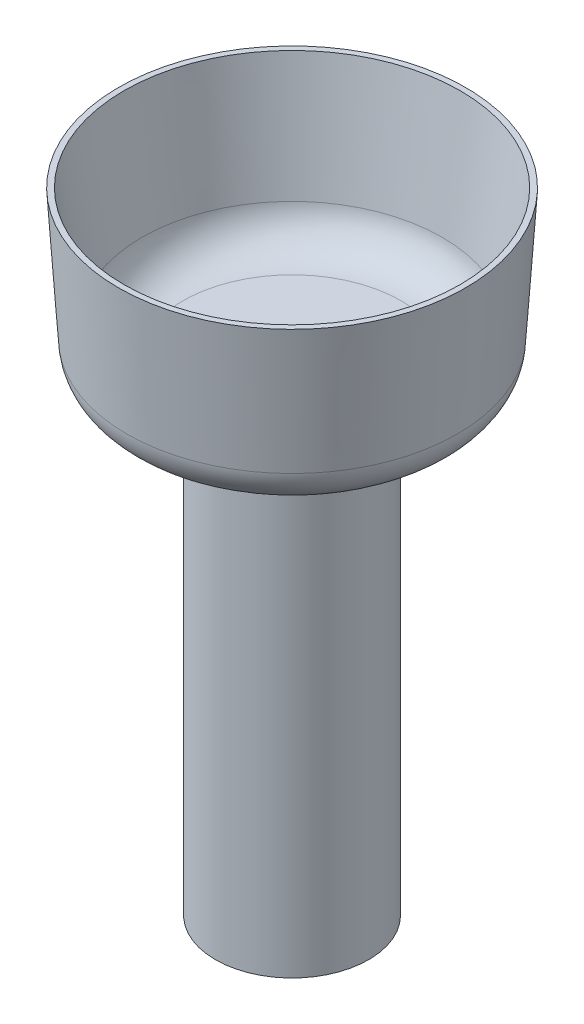
ISO-10303-21;
HEADER;
FILE_DESCRIPTION(('STEP AP214'),'2;1');
FILE_NAME('part.step','',(''),(''),'','','');
FILE_SCHEMA(('AUTOMOTIVE_DESIGN { 1 0 10303 214 1 1 1 1 }'));
ENDSEC;
DATA;
#1=APPLICATION_CONTEXT('core data for automotive mechanical design processes');
#2=APPLICATION_PROTOCOL_DEFINITION('international standard','automotive_design',2000,#1);
#3=PRODUCT_CONTEXT('',#1,'mechanical');
#4=PRODUCT('Part','Part','',(#3));
#5=PRODUCT_RELATED_PRODUCT_CATEGORY('part','',(#4));
#6=PRODUCT_DEFINITION_FORMATION('','',#4);
#7=PRODUCT_DEFINITION_CONTEXT('part definition',#1,'design');
#8=PRODUCT_DEFINITION('design','',#6,#7);
#9=PRODUCT_DEFINITION_SHAPE('','',#8);
#10=(LENGTH_UNIT() NAMED_UNIT(*) SI_UNIT(.MILLI.,.METRE.));
#11=(NAMED_UNIT(*) PLANE_ANGLE_UNIT() SI_UNIT($,.RADIAN.));
#12=(NAMED_UNIT(*) SI_UNIT($,.STERADIAN.) SOLID_ANGLE_UNIT());
#13=UNCERTAINTY_MEASURE_WITH_UNIT(LENGTH_MEASURE(1.E-05),#10,'distance_accuracy_value','');
#14=(GEOMETRIC_REPRESENTATION_CONTEXT(3) GLOBAL_UNCERTAINTY_ASSIGNED_CONTEXT((#13)) GLOBAL_UNIT_ASSIGNED_CONTEXT((#10,
#11,#12)) REPRESENTATION_CONTEXT('',''));
#15=CARTESIAN_POINT('',(0.,0.,0.));
#16=DIRECTION('',(0.,0.,1.));
#17=DIRECTION('',(1.,0.,0.));
#18=AXIS2_PLACEMENT_3D('',#15,#16,#17);
#19=CARTESIAN_POINT('',(0.,33.67,0.));
#20=DIRECTION('',(0.,-1.,0.));
#21=DIRECTION('',(0.,0.,-1.));
#22=AXIS2_PLACEMENT_3D('',#19,#20,#21);
#23=CYLINDRICAL_SURFACE('',#22,5.6);
#24=CARTESIAN_POINT('',(0.,33.67,0.));
#25=DIRECTION('',(0.,1.,0.));
#26=DIRECTION('',(0.,0.,1.));
#27=AXIS2_PLACEMENT_3D('',#24,#25,#26);
#28=CIRCLE('',#27,5.6);
#29=CARTESIAN_POINT('',(0.,33.67,5.6));
#30=VERTEX_POINT('',#29);
#31=EDGE_CURVE('E58',#30,#30,#28,.T.);
#32=ORIENTED_EDGE('',*,*,#31,.F.);
#33=EDGE_LOOP('',(#32));
#34=FACE_BOUND('',#33,.T.);
#35=CARTESIAN_POINT('',(0.,0.,0.));
#36=DIRECTION('',(0.,1.,0.));
#37=DIRECTION('',(0.,0.,1.));
#38=AXIS2_PLACEMENT_3D('',#35,#36,#37);
#39=CIRCLE('',#38,5.6);
#40=CARTESIAN_POINT('',(0.,0.,5.6));
#41=VERTEX_POINT('',#40);
#42=EDGE_CURVE('E59',#41,#41,#39,.T.);
#43=ORIENTED_EDGE('',*,*,#42,.T.);
#44=EDGE_LOOP('',(#43));
#45=FACE_BOUND('',#44,.T.);
#46=ADVANCED_FACE('F35',(#34,#45),#23,.T.);
#47=CARTESIAN_POINT('',(0.,0.,0.));
#48=DIRECTION('',(0.,1.,0.));
#49=DIRECTION('',(0.,0.,1.));
#50=AXIS2_PLACEMENT_3D('',#47,#48,#49);
#51=PLANE('',#50);
#52=ORIENTED_EDGE('',*,*,#42,.F.);
#53=EDGE_LOOP('',(#52));
#54=FACE_BOUND('',#53,.T.);
#55=ADVANCED_FACE('F85',(#54),#51,.F.);
#56=CARTESIAN_POINT('',(0.,46.03,0.));
#57=DIRECTION('',(0.,1.,0.));
#58=DIRECTION('',(0.,0.,1.));
#59=AXIS2_PLACEMENT_3D('',#56,#57,#58);
#60=PLANE('',#59);
#61=CARTESIAN_POINT('',(0.,46.03,0.));
#62=DIRECTION('',(0.,1.,0.));
#63=DIRECTION('',(0.,0.,1.));
#64=AXIS2_PLACEMENT_3D('',#61,#62,#63);
#65=CIRCLE('',#64,12.2725513561616);
#66=CARTESIAN_POINT('',(0.,46.03,12.2725513561616));
#67=VERTEX_POINT('',#66);
#68=EDGE_CURVE('E46',#67,#67,#65,.F.);
#69=ORIENTED_EDGE('',*,*,#68,.T.);
#70=EDGE_LOOP('',(#69));
#71=FACE_BOUND('',#70,.T.);
#72=CARTESIAN_POINT('',(0.,46.03,0.));
#73=DIRECTION('',(0.,1.,0.));
#74=DIRECTION('',(0.,0.,1.));
#75=AXIS2_PLACEMENT_3D('',#72,#73,#74);
#76=CIRCLE('',#75,12.675);
#77=CARTESIAN_POINT('',(0.,46.03,12.675));
#78=VERTEX_POINT('',#77);
#79=EDGE_CURVE('E62',#78,#78,#76,.T.);
#80=ORIENTED_EDGE('',*,*,#79,.T.);
#81=EDGE_LOOP('',(#80));
#82=FACE_BOUND('',#81,.T.);
#83=ADVANCED_FACE('F74',(#71,#82),#60,.T.);
#84=CARTESIAN_POINT('',(0.,33.67,0.));
#85=DIRECTION('',(0.,1.,0.));
#86=DIRECTION('',(0.,0.,1.));
#87=AXIS2_PLACEMENT_3D('',#84,#85,#86);
#88=PLANE('',#87);
#89=CARTESIAN_POINT('',(0.,33.67,0.));
#90=DIRECTION('',(0.,1.,0.));
#91=DIRECTION('',(0.,0.,1.));
#92=AXIS2_PLACEMENT_3D('',#89,#90,#91);
#93=CIRCLE('',#92,9.07062596321943);
#94=CARTESIAN_POINT('',(0.,33.67,9.07062596321943));
#95=VERTEX_POINT('',#94);
#96=EDGE_CURVE('E50',#95,#95,#93,.F.);
#97=ORIENTED_EDGE('',*,*,#96,.T.);
#98=EDGE_LOOP('',(#97));
#99=FACE_BOUND('',#98,.T.);
#100=ORIENTED_EDGE('',*,*,#31,.T.);
#101=EDGE_LOOP('',(#100));
#102=FACE_BOUND('',#101,.T.);
#103=ADVANCED_FACE('F84',(#99,#102),#88,.F.);
#104=CARTESIAN_POINT('',(0.,33.67,0.));
#105=DIRECTION('',(0.,1.,0.));
#106=DIRECTION('',(0.,0.,1.));
#107=AXIS2_PLACEMENT_3D('',#104,#105,#106);
#108=CONICAL_SURFACE('',#107,11.885,0.0638290331860114);
#109=CARTESIAN_POINT('',(0.,36.4786428983411,0.));
#110=DIRECTION('',(0.,1.,0.));
#111=DIRECTION('',(0.,0.,1.));
#112=AXIS2_PLACEMENT_3D('',#109,#110,#111);
#113=CIRCLE('',#112,12.0645168195542);
#114=CARTESIAN_POINT('',(0.,36.4786428983411,12.0645168195542));
#115=VERTEX_POINT('',#114);
#116=EDGE_CURVE('E55',#115,#115,#113,.T.);
#117=ORIENTED_EDGE('',*,*,#116,.T.);
#118=EDGE_LOOP('',(#117));
#119=FACE_BOUND('',#118,.T.);
#120=ORIENTED_EDGE('',*,*,#79,.F.);
#121=EDGE_LOOP('',(#120));
#122=FACE_BOUND('',#121,.T.);
#123=ADVANCED_FACE('F87',(#119,#122),#108,.T.);
#124=CARTESIAN_POINT('',(0.,34.87,0.));
#125=DIRECTION('',(0.,1.,0.));
#126=DIRECTION('',(0.,0.,1.));
#127=AXIS2_PLACEMENT_3D('',#124,#125,#126);
#128=PLANE('',#127);
#129=CARTESIAN_POINT('',(0.,34.87,0.));
#130=DIRECTION('',(0.,1.,0.));
#131=DIRECTION('',(0.,0.,1.));
#132=AXIS2_PLACEMENT_3D('',#129,#130,#131);
#133=CIRCLE('',#132,7.98928047196131);
#134=CARTESIAN_POINT('',(0.,34.87,7.98928047196131));
#135=VERTEX_POINT('',#134);
#136=EDGE_CURVE('E42',#135,#135,#133,.T.);
#137=ORIENTED_EDGE('',*,*,#136,.T.);
#138=EDGE_LOOP('',(#137));
#139=FACE_BOUND('',#138,.T.);
#140=ADVANCED_FACE('F99',(#139),#128,.T.);
#141=CARTESIAN_POINT('',(0.,36.67,0.));
#142=DIRECTION('',(0.,1.,0.));
#143=DIRECTION('',(0.,0.,1.));
#144=AXIS2_PLACEMENT_3D('',#141,#142,#143);
#145=TOROIDAL_SURFACE('',#144,9.07062596321943,3.);
#146=ORIENTED_EDGE('',*,*,#96,.F.);
#147=EDGE_LOOP('',(#146));
#148=FACE_BOUND('',#147,.T.);
#149=ORIENTED_EDGE('',*,*,#116,.F.);
#150=EDGE_LOOP('',(#149));
#151=FACE_BOUND('',#150,.T.);
#152=ADVANCED_FACE('F96',(#148,#151),#145,.T.);
#153=CARTESIAN_POINT('',(0.,37.0483274309956,0.));
#154=DIRECTION('',(0.,1.,0.));
#155=DIRECTION('',(0.,0.,1.));
#156=AXIS2_PLACEMENT_3D('',#153,#154,#155);
#157=CONICAL_SURFACE('',#156,10.8984800511847,0.151809078663356);
#158=CARTESIAN_POINT('',(0.,37.41632004514,0.));
#159=DIRECTION('',(0.,1.,0.));
#160=DIRECTION('',(0.,0.,1.));
#161=AXIS2_PLACEMENT_3D('',#158,#159,#160);
#162=CIRCLE('',#161,10.9547778161783);
#163=CARTESIAN_POINT('',(0.,37.41632004514,10.9547778161783));
#164=VERTEX_POINT('',#163);
#165=EDGE_CURVE('E11',#164,#164,#162,.F.);
#166=ORIENTED_EDGE('',*,*,#165,.T.);
#167=EDGE_LOOP('',(#166));
#168=FACE_BOUND('',#167,.T.);
#169=ORIENTED_EDGE('',*,*,#68,.F.);
#170=EDGE_LOOP('',(#169));
#171=FACE_BOUND('',#170,.T.);
#172=ADVANCED_FACE('F98',(#168,#171),#157,.F.);
#173=CARTESIAN_POINT('',(0.,37.87,0.));
#174=DIRECTION('',(0.,1.,0.));
#175=DIRECTION('',(0.,0.,1.));
#176=AXIS2_PLACEMENT_3D('',#173,#174,#175);
#177=TOROIDAL_SURFACE('',#176,7.98928047196131,3.);
#178=ORIENTED_EDGE('',*,*,#165,.F.);
#179=EDGE_LOOP('',(#178));
#180=FACE_BOUND('',#179,.T.);
#181=ORIENTED_EDGE('',*,*,#136,.F.);
#182=EDGE_LOOP('',(#181));
#183=FACE_BOUND('',#182,.T.);
#184=ADVANCED_FACE('F37',(#180,#183),#177,.F.);
#185=CLOSED_SHELL('',(#46,#55,#83,#103,#123,#140,#152,#172,#184));
#186=MANIFOLD_SOLID_BREP('B2',#185);
#187=ADVANCED_BREP_SHAPE_REPRESENTATION('',(#18,#186),#14);
#188=SHAPE_DEFINITION_REPRESENTATION(#9,#187);
ENDSEC;
END-ISO-10303-21;
